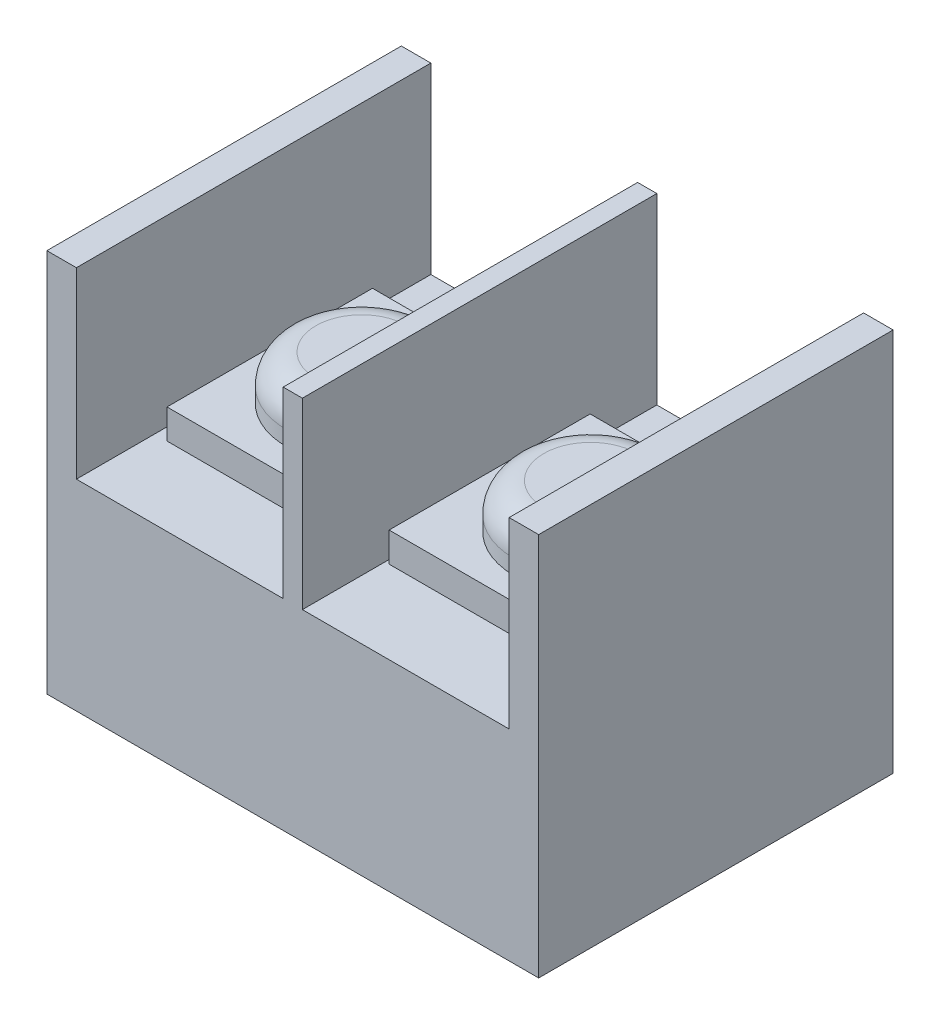
ISO-10303-21;
HEADER;
FILE_DESCRIPTION(('STEP AP214'),'2;1');
FILE_NAME('part.step','',(''),(''),'','','');
FILE_SCHEMA(('AUTOMOTIVE_DESIGN { 1 0 10303 214 1 1 1 1 }'));
ENDSEC;
DATA;
#1=APPLICATION_CONTEXT('core data for automotive mechanical design processes');
#2=APPLICATION_PROTOCOL_DEFINITION('international standard','automotive_design',2000,#1);
#3=PRODUCT_CONTEXT('',#1,'mechanical');
#4=PRODUCT('Part','Part','',(#3));
#5=PRODUCT_RELATED_PRODUCT_CATEGORY('part','',(#4));
#6=PRODUCT_DEFINITION_FORMATION('','',#4);
#7=PRODUCT_DEFINITION_CONTEXT('part definition',#1,'design');
#8=PRODUCT_DEFINITION('design','',#6,#7);
#9=PRODUCT_DEFINITION_SHAPE('','',#8);
#10=(LENGTH_UNIT() NAMED_UNIT(*) SI_UNIT(.MILLI.,.METRE.));
#11=(NAMED_UNIT(*) PLANE_ANGLE_UNIT() SI_UNIT($,.RADIAN.));
#12=(NAMED_UNIT(*) SI_UNIT($,.STERADIAN.) SOLID_ANGLE_UNIT());
#13=UNCERTAINTY_MEASURE_WITH_UNIT(LENGTH_MEASURE(1.E-05),#10,'distance_accuracy_value','');
#14=(GEOMETRIC_REPRESENTATION_CONTEXT(3) GLOBAL_UNCERTAINTY_ASSIGNED_CONTEXT((#13)) GLOBAL_UNIT_ASSIGNED_CONTEXT((#10,
#11,#12)) REPRESENTATION_CONTEXT('',''));
#15=CARTESIAN_POINT('',(0.,0.,0.));
#16=DIRECTION('',(0.,0.,1.));
#17=DIRECTION('',(1.,0.,0.));
#18=AXIS2_PLACEMENT_3D('',#15,#16,#17);
#19=CARTESIAN_POINT('',(-0.133958652373657,6.8,-7.62940275650842));
#20=DIRECTION('',(0.,-1.,0.));
#21=DIRECTION('',(1.,0.,0.));
#22=AXIS2_PLACEMENT_3D('',#19,#20,#21);
#23=PLANE('',#22);
#24=DIRECTION('',(0.,0.,1.));
#25=VECTOR('',#24,1.);
#26=CARTESIAN_POINT('',(-0.133958652373657,6.8,-7.62940275650842));
#27=LINE('',#26,#25);
#28=CARTESIAN_POINT('',(-0.133958652373657,6.8,-6.62940275650842));
#29=VERTEX_POINT('',#28);
#30=CARTESIAN_POINT('',(-0.133958652373657,6.8,5.37059724349158));
#31=VERTEX_POINT('',#30);
#32=EDGE_CURVE('E253',#29,#31,#27,.T.);
#33=ORIENTED_EDGE('',*,*,#32,.T.);
#34=DIRECTION('',(1.,0.,0.));
#35=VECTOR('',#34,1.);
#36=CARTESIAN_POINT('',(-0.133958652373657,6.8,5.37059724349158));
#37=LINE('',#36,#35);
#38=CARTESIAN_POINT('',(6.86604134762634,6.8,5.37059724349158));
#39=VERTEX_POINT('',#38);
#40=EDGE_CURVE('E248',#31,#39,#37,.T.);
#41=ORIENTED_EDGE('',*,*,#40,.T.);
#42=DIRECTION('',(0.,0.,1.));
#43=VECTOR('',#42,1.);
#44=CARTESIAN_POINT('',(6.86604134762634,6.8,-7.62940275650842));
#45=LINE('',#44,#43);
#46=CARTESIAN_POINT('',(6.86604134762634,6.8,-6.62940275650842));
#47=VERTEX_POINT('',#46);
#48=EDGE_CURVE('E236',#47,#39,#45,.T.);
#49=ORIENTED_EDGE('',*,*,#48,.F.);
#50=DIRECTION('',(1.,0.,0.));
#51=VECTOR('',#50,1.);
#52=CARTESIAN_POINT('',(-8.78395865237366,6.8,-6.62940275650842));
#53=LINE('',#52,#51);
#54=EDGE_CURVE('E311',#29,#47,#53,.T.);
#55=ORIENTED_EDGE('',*,*,#54,.F.);
#56=EDGE_LOOP('',(#33,#41,#49,#55));
#57=FACE_BOUND('',#56,.T.);
#58=DIRECTION('',(0.,0.,1.));
#59=VECTOR('',#58,1.);
#60=CARTESIAN_POINT('',(0.,6.8,-4.23776581016648));
#61=LINE('',#60,#59);
#62=CARTESIAN_POINT('',(0.,6.8,-4.23776581016648));
#63=VERTEX_POINT('',#62);
#64=CARTESIAN_POINT('',(0.,6.8,2.56891904105213));
#65=VERTEX_POINT('',#64);
#66=EDGE_CURVE('E192',#63,#65,#61,.T.);
#67=ORIENTED_EDGE('',*,*,#66,.F.);
#68=DIRECTION('',(-1.,0.,0.));
#69=VECTOR('',#68,1.);
#70=CARTESIAN_POINT('',(0.,6.8,-4.23776581016648));
#71=LINE('',#70,#69);
#72=CARTESIAN_POINT('',(6.60058497343841,6.8,-4.23776581016648));
#73=VERTEX_POINT('',#72);
#74=EDGE_CURVE('E189',#73,#63,#71,.T.);
#75=ORIENTED_EDGE('',*,*,#74,.F.);
#76=DIRECTION('',(0.,0.,-1.));
#77=VECTOR('',#76,1.);
#78=CARTESIAN_POINT('',(6.60058497343841,6.8,-4.23776581016648));
#79=LINE('',#78,#77);
#80=CARTESIAN_POINT('',(6.60058497343841,6.8,2.56891904105213));
#81=VERTEX_POINT('',#80);
#82=EDGE_CURVE('E55',#81,#73,#79,.T.);
#83=ORIENTED_EDGE('',*,*,#82,.F.);
#84=DIRECTION('',(1.,0.,0.));
#85=VECTOR('',#84,1.);
#86=CARTESIAN_POINT('',(0.,6.8,2.56891904105213));
#87=LINE('',#86,#85);
#88=EDGE_CURVE('E50',#65,#81,#87,.T.);
#89=ORIENTED_EDGE('',*,*,#88,.F.);
#90=EDGE_LOOP('',(#67,#75,#83,#89));
#91=FACE_BOUND('',#90,.T.);
#92=ADVANCED_FACE('F35',(#57,#91),#23,.F.);
#93=CARTESIAN_POINT('',(-7.78395865237366,6.8,-7.62940275650842));
#94=DIRECTION('',(0.,-1.,0.));
#95=DIRECTION('',(1.,0.,0.));
#96=AXIS2_PLACEMENT_3D('',#93,#94,#95);
#97=PLANE('',#96);
#98=DIRECTION('',(0.,0.,1.));
#99=VECTOR('',#98,1.);
#100=CARTESIAN_POINT('',(-7.78395865237366,6.8,-7.62940275650842));
#101=LINE('',#100,#99);
#102=CARTESIAN_POINT('',(-7.78395865237366,6.8,-6.62940275650842));
#103=VERTEX_POINT('',#102);
#104=CARTESIAN_POINT('',(-7.78395865237366,6.8,5.37059724349158));
#105=VERTEX_POINT('',#104);
#106=EDGE_CURVE('E241',#103,#105,#101,.T.);
#107=ORIENTED_EDGE('',*,*,#106,.T.);
#108=DIRECTION('',(1.,0.,0.));
#109=VECTOR('',#108,1.);
#110=CARTESIAN_POINT('',(-7.78395865237366,6.8,5.37059724349158));
#111=LINE('',#110,#109);
#112=CARTESIAN_POINT('',(-0.783958652373657,6.8,5.37059724349158));
#113=VERTEX_POINT('',#112);
#114=EDGE_CURVE('E235',#105,#113,#111,.T.);
#115=ORIENTED_EDGE('',*,*,#114,.T.);
#116=DIRECTION('',(0.,0.,1.));
#117=VECTOR('',#116,1.);
#118=CARTESIAN_POINT('',(-0.783958652373657,6.8,-7.62940275650842));
#119=LINE('',#118,#117);
#120=CARTESIAN_POINT('',(-0.783958652373657,6.8,-6.62940275650842));
#121=VERTEX_POINT('',#120);
#122=EDGE_CURVE('E242',#121,#113,#119,.T.);
#123=ORIENTED_EDGE('',*,*,#122,.F.);
#124=DIRECTION('',(1.,0.,0.));
#125=VECTOR('',#124,1.);
#126=CARTESIAN_POINT('',(-8.78395865237366,6.8,-6.62940275650842));
#127=LINE('',#126,#125);
#128=EDGE_CURVE('E314',#103,#121,#127,.T.);
#129=ORIENTED_EDGE('',*,*,#128,.F.);
#130=EDGE_LOOP('',(#107,#115,#123,#129));
#131=FACE_BOUND('',#130,.T.);
#132=DIRECTION('',(0.,0.,1.));
#133=VECTOR('',#132,1.);
#134=CARTESIAN_POINT('',(-7.36815381761664,6.8,-4.23776581016648));
#135=LINE('',#134,#133);
#136=CARTESIAN_POINT('',(-7.36815381761664,6.8,-4.23776581016648));
#137=VERTEX_POINT('',#136);
#138=CARTESIAN_POINT('',(-7.36815381761664,6.8,2.71926750162121));
#139=VERTEX_POINT('',#138);
#140=EDGE_CURVE('E193',#137,#139,#135,.T.);
#141=ORIENTED_EDGE('',*,*,#140,.F.);
#142=DIRECTION('',(-1.,0.,0.));
#143=VECTOR('',#142,1.);
#144=CARTESIAN_POINT('',(-7.36815381761664,6.8,-4.23776581016648));
#145=LINE('',#144,#143);
#146=CARTESIAN_POINT('',(-1.01251434810529,6.8,-4.23776581016648));
#147=VERTEX_POINT('',#146);
#148=EDGE_CURVE('E206',#147,#137,#145,.T.);
#149=ORIENTED_EDGE('',*,*,#148,.F.);
#150=DIRECTION('',(0.,0.,-1.));
#151=VECTOR('',#150,1.);
#152=CARTESIAN_POINT('',(-1.01251434810529,6.8,-4.23776581016648));
#153=LINE('',#152,#151);
#154=CARTESIAN_POINT('',(-1.01251434810529,6.8,2.71926750162121));
#155=VERTEX_POINT('',#154);
#156=EDGE_CURVE('E215',#155,#147,#153,.T.);
#157=ORIENTED_EDGE('',*,*,#156,.F.);
#158=DIRECTION('',(1.,0.,0.));
#159=VECTOR('',#158,1.);
#160=CARTESIAN_POINT('',(-7.36815381761664,6.8,2.71926750162121));
#161=LINE('',#160,#159);
#162=EDGE_CURVE('E196',#139,#155,#161,.T.);
#163=ORIENTED_EDGE('',*,*,#162,.F.);
#164=EDGE_LOOP('',(#141,#149,#157,#163));
#165=FACE_BOUND('',#164,.T.);
#166=ADVANCED_FACE('F339',(#131,#165),#97,.F.);
#167=CARTESIAN_POINT('',(0.,13.,0.));
#168=DIRECTION('',(0.,1.,0.));
#169=DIRECTION('',(0.,0.,1.));
#170=AXIS2_PLACEMENT_3D('',#167,#168,#169);
#171=PLANE('',#170);
#172=DIRECTION('',(0.,0.,1.));
#173=VECTOR('',#172,1.);
#174=CARTESIAN_POINT('',(-7.78395865237366,13.,0.));
#175=LINE('',#174,#173);
#176=CARTESIAN_POINT('',(-7.78395865237366,13.,-6.62940275650842));
#177=VERTEX_POINT('',#176);
#178=CARTESIAN_POINT('',(-7.78395865237366,13.,5.37059724349158));
#179=VERTEX_POINT('',#178);
#180=EDGE_CURVE('E309',#177,#179,#175,.T.);
#181=ORIENTED_EDGE('',*,*,#180,.F.);
#182=DIRECTION('',(-1.,0.,0.));
#183=VECTOR('',#182,1.);
#184=CARTESIAN_POINT('',(-8.78395865237366,13.,-6.62940275650842));
#185=LINE('',#184,#183);
#186=CARTESIAN_POINT('',(-8.78395865237366,13.,-6.62940275650842));
#187=VERTEX_POINT('',#186);
#188=EDGE_CURVE('E279',#177,#187,#185,.T.);
#189=ORIENTED_EDGE('',*,*,#188,.T.);
#190=DIRECTION('',(0.,0.,1.));
#191=VECTOR('',#190,1.);
#192=CARTESIAN_POINT('',(-8.78395865237366,13.,-6.62940275650842));
#193=LINE('',#192,#191);
#194=CARTESIAN_POINT('',(-8.78395865237366,13.,5.37059724349158));
#195=VERTEX_POINT('',#194);
#196=EDGE_CURVE('E268',#187,#195,#193,.T.);
#197=ORIENTED_EDGE('',*,*,#196,.T.);
#198=DIRECTION('',(1.,0.,0.));
#199=VECTOR('',#198,1.);
#200=CARTESIAN_POINT('',(-8.78395865237366,13.,5.37059724349158));
#201=LINE('',#200,#199);
#202=EDGE_CURVE('E273',#195,#179,#201,.T.);
#203=ORIENTED_EDGE('',*,*,#202,.T.);
#204=EDGE_LOOP('',(#181,#189,#197,#203));
#205=FACE_BOUND('',#204,.T.);
#206=ADVANCED_FACE('F345',(#205),#171,.T.);
#207=DIRECTION('',(0.,0.,-1.));
#208=VECTOR('',#207,1.);
#209=CARTESIAN_POINT('',(-0.783958652373658,13.,0.));
#210=LINE('',#209,#208);
#211=CARTESIAN_POINT('',(-0.783958652373656,13.,5.37059724349158));
#212=VERTEX_POINT('',#211);
#213=CARTESIAN_POINT('',(-0.783958652373658,13.,-6.62940275650842));
#214=VERTEX_POINT('',#213);
#215=EDGE_CURVE('E307',#212,#214,#210,.T.);
#216=ORIENTED_EDGE('',*,*,#215,.F.);
#217=CARTESIAN_POINT('',(-0.133958652373658,13.,5.37059724349158));
#218=VERTEX_POINT('',#217);
#219=EDGE_CURVE('E277',#212,#218,#201,.T.);
#220=ORIENTED_EDGE('',*,*,#219,.T.);
#221=DIRECTION('',(0.,0.,1.));
#222=VECTOR('',#221,1.);
#223=CARTESIAN_POINT('',(-0.133958652373658,13.,0.));
#224=LINE('',#223,#222);
#225=CARTESIAN_POINT('',(-0.133958652373658,13.,-6.62940275650842));
#226=VERTEX_POINT('',#225);
#227=EDGE_CURVE('E305',#226,#218,#224,.T.);
#228=ORIENTED_EDGE('',*,*,#227,.F.);
#229=EDGE_CURVE('E284',#226,#214,#185,.T.);
#230=ORIENTED_EDGE('',*,*,#229,.T.);
#231=EDGE_LOOP('',(#216,#220,#228,#230));
#232=FACE_BOUND('',#231,.T.);
#233=ADVANCED_FACE('F362',(#232),#171,.T.);
#234=CARTESIAN_POINT('',(-8.78395865237366,13.,-6.62940275650842));
#235=DIRECTION('',(1.,0.,0.));
#236=DIRECTION('',(0.,0.,-1.));
#237=AXIS2_PLACEMENT_3D('',#234,#235,#236);
#238=PLANE('',#237);
#239=DIRECTION('',(0.,0.,1.));
#240=VECTOR('',#239,1.);
#241=CARTESIAN_POINT('',(-8.78395865237366,0.,-6.62940275650842));
#242=LINE('',#241,#240);
#243=CARTESIAN_POINT('',(-8.78395865237366,0.,-6.62940275650842));
#244=VERTEX_POINT('',#243);
#245=CARTESIAN_POINT('',(-8.78395865237366,0.,5.37059724349158));
#246=VERTEX_POINT('',#245);
#247=EDGE_CURVE('E267',#244,#246,#242,.T.);
#248=ORIENTED_EDGE('',*,*,#247,.T.);
#249=DIRECTION('',(0.,-1.,0.));
#250=VECTOR('',#249,1.);
#251=CARTESIAN_POINT('',(-8.78395865237366,13.,5.37059724349158));
#252=LINE('',#251,#250);
#253=EDGE_CURVE('E300',#195,#246,#252,.T.);
#254=ORIENTED_EDGE('',*,*,#253,.F.);
#255=ORIENTED_EDGE('',*,*,#196,.F.);
#256=DIRECTION('',(0.,-1.,0.));
#257=VECTOR('',#256,1.);
#258=CARTESIAN_POINT('',(-8.78395865237366,13.,-6.62940275650842));
#259=LINE('',#258,#257);
#260=EDGE_CURVE('E283',#187,#244,#259,.T.);
#261=ORIENTED_EDGE('',*,*,#260,.T.);
#262=EDGE_LOOP('',(#248,#254,#255,#261));
#263=FACE_BOUND('',#262,.T.);
#264=ADVANCED_FACE('F376',(#263),#238,.F.);
#265=CARTESIAN_POINT('',(-8.78395865237366,13.,5.37059724349158));
#266=DIRECTION('',(0.,0.,-1.));
#267=DIRECTION('',(-1.,0.,0.));
#268=AXIS2_PLACEMENT_3D('',#265,#266,#267);
#269=PLANE('',#268);
#270=ORIENTED_EDGE('',*,*,#114,.F.);
#271=DIRECTION('',(0.,-1.,0.));
#272=VECTOR('',#271,1.);
#273=CARTESIAN_POINT('',(-7.78395865237366,17.3249514809849,5.37059724349158));
#274=LINE('',#273,#272);
#275=EDGE_CURVE('E232',#179,#105,#274,.T.);
#276=ORIENTED_EDGE('',*,*,#275,.F.);
#277=ORIENTED_EDGE('',*,*,#202,.F.);
#278=ORIENTED_EDGE('',*,*,#253,.T.);
#279=DIRECTION('',(1.,0.,0.));
#280=VECTOR('',#279,1.);
#281=CARTESIAN_POINT('',(-8.78395865237366,0.,5.37059724349158));
#282=LINE('',#281,#280);
#283=CARTESIAN_POINT('',(7.86604134762634,0.,5.37059724349158));
#284=VERTEX_POINT('',#283);
#285=EDGE_CURVE('E287',#246,#284,#282,.T.);
#286=ORIENTED_EDGE('',*,*,#285,.T.);
#287=DIRECTION('',(0.,-1.,0.));
#288=VECTOR('',#287,1.);
#289=CARTESIAN_POINT('',(7.86604134762634,13.,5.37059724349158));
#290=LINE('',#289,#288);
#291=CARTESIAN_POINT('',(7.86604134762634,13.,5.37059724349158));
#292=VERTEX_POINT('',#291);
#293=EDGE_CURVE('E297',#292,#284,#290,.T.);
#294=ORIENTED_EDGE('',*,*,#293,.F.);
#295=CARTESIAN_POINT('',(6.86604134762634,13.,5.37059724349158));
#296=VERTEX_POINT('',#295);
#297=EDGE_CURVE('E271',#296,#292,#201,.T.);
#298=ORIENTED_EDGE('',*,*,#297,.F.);
#299=DIRECTION('',(0.,1.,0.));
#300=VECTOR('',#299,1.);
#301=CARTESIAN_POINT('',(6.86604134762634,17.3249514809849,5.37059724349158));
#302=LINE('',#301,#300);
#303=EDGE_CURVE('E251',#39,#296,#302,.T.);
#304=ORIENTED_EDGE('',*,*,#303,.F.);
#305=ORIENTED_EDGE('',*,*,#40,.F.);
#306=DIRECTION('',(0.,-1.,0.));
#307=VECTOR('',#306,1.);
#308=CARTESIAN_POINT('',(-0.133958652373659,17.3249514809849,5.37059724349158));
#309=LINE('',#308,#307);
#310=EDGE_CURVE('E231',#218,#31,#309,.T.);
#311=ORIENTED_EDGE('',*,*,#310,.F.);
#312=ORIENTED_EDGE('',*,*,#219,.F.);
#313=DIRECTION('',(0.,1.,0.));
#314=VECTOR('',#313,1.);
#315=CARTESIAN_POINT('',(-0.783958652373658,17.3249514809849,5.37059724349158));
#316=LINE('',#315,#314);
#317=EDGE_CURVE('E239',#113,#212,#316,.T.);
#318=ORIENTED_EDGE('',*,*,#317,.F.);
#319=EDGE_LOOP('',(#270,#276,#277,#278,#286,#294,#298,#304,#305,#311,#312,#318));
#320=FACE_BOUND('',#319,.T.);
#321=ADVANCED_FACE('F372',(#320),#269,.F.);
#322=CARTESIAN_POINT('',(7.86604134762634,13.,-6.62940275650842));
#323=DIRECTION('',(-1.,0.,0.));
#324=DIRECTION('',(0.,0.,1.));
#325=AXIS2_PLACEMENT_3D('',#322,#323,#324);
#326=PLANE('',#325);
#327=DIRECTION('',(0.,0.,-1.));
#328=VECTOR('',#327,1.);
#329=CARTESIAN_POINT('',(7.86604134762634,0.,-6.62940275650842));
#330=LINE('',#329,#328);
#331=CARTESIAN_POINT('',(7.86604134762634,0.,-6.62940275650842));
#332=VERTEX_POINT('',#331);
#333=EDGE_CURVE('E289',#284,#332,#330,.T.);
#334=ORIENTED_EDGE('',*,*,#333,.T.);
#335=DIRECTION('',(0.,-1.,0.));
#336=VECTOR('',#335,1.);
#337=CARTESIAN_POINT('',(7.86604134762634,13.,-6.62940275650842));
#338=LINE('',#337,#336);
#339=CARTESIAN_POINT('',(7.86604134762634,13.,-6.62940275650842));
#340=VERTEX_POINT('',#339);
#341=EDGE_CURVE('E294',#340,#332,#338,.T.);
#342=ORIENTED_EDGE('',*,*,#341,.F.);
#343=DIRECTION('',(0.,0.,-1.));
#344=VECTOR('',#343,1.);
#345=CARTESIAN_POINT('',(7.86604134762634,13.,-6.62940275650842));
#346=LINE('',#345,#344);
#347=EDGE_CURVE('E276',#292,#340,#346,.T.);
#348=ORIENTED_EDGE('',*,*,#347,.F.);
#349=ORIENTED_EDGE('',*,*,#293,.T.);
#350=EDGE_LOOP('',(#334,#342,#348,#349));
#351=FACE_BOUND('',#350,.T.);
#352=ADVANCED_FACE('F368',(#351),#326,.F.);
#353=CARTESIAN_POINT('',(-8.78395865237366,13.,-6.62940275650842));
#354=DIRECTION('',(0.,0.,1.));
#355=DIRECTION('',(1.,0.,0.));
#356=AXIS2_PLACEMENT_3D('',#353,#354,#355);
#357=PLANE('',#356);
#358=ORIENTED_EDGE('',*,*,#188,.F.);
#359=DIRECTION('',(0.,-1.,0.));
#360=VECTOR('',#359,1.);
#361=CARTESIAN_POINT('',(-7.78395865237366,13.,-6.62940275650842));
#362=LINE('',#361,#360);
#363=EDGE_CURVE('E264',#177,#103,#362,.T.);
#364=ORIENTED_EDGE('',*,*,#363,.T.);
#365=ORIENTED_EDGE('',*,*,#128,.T.);
#366=DIRECTION('',(0.,1.,0.));
#367=VECTOR('',#366,1.);
#368=CARTESIAN_POINT('',(-0.78395865237366,13.,-6.62940275650842));
#369=LINE('',#368,#367);
#370=EDGE_CURVE('E261',#121,#214,#369,.T.);
#371=ORIENTED_EDGE('',*,*,#370,.T.);
#372=ORIENTED_EDGE('',*,*,#229,.F.);
#373=DIRECTION('',(0.,-1.,0.));
#374=VECTOR('',#373,1.);
#375=CARTESIAN_POINT('',(-0.13395865237366,13.,-6.62940275650842));
#376=LINE('',#375,#374);
#377=EDGE_CURVE('E258',#226,#29,#376,.T.);
#378=ORIENTED_EDGE('',*,*,#377,.T.);
#379=ORIENTED_EDGE('',*,*,#54,.T.);
#380=DIRECTION('',(0.,1.,0.));
#381=VECTOR('',#380,1.);
#382=CARTESIAN_POINT('',(6.86604134762634,13.,-6.62940275650842));
#383=LINE('',#382,#381);
#384=CARTESIAN_POINT('',(6.86604134762634,13.,-6.62940275650842));
#385=VERTEX_POINT('',#384);
#386=EDGE_CURVE('E244',#47,#385,#383,.T.);
#387=ORIENTED_EDGE('',*,*,#386,.T.);
#388=EDGE_CURVE('E280',#340,#385,#185,.T.);
#389=ORIENTED_EDGE('',*,*,#388,.F.);
#390=ORIENTED_EDGE('',*,*,#341,.T.);
#391=DIRECTION('',(-1.,0.,0.));
#392=VECTOR('',#391,1.);
#393=CARTESIAN_POINT('',(-8.78395865237366,0.,-6.62940275650842));
#394=LINE('',#393,#392);
#395=EDGE_CURVE('E272',#332,#244,#394,.T.);
#396=ORIENTED_EDGE('',*,*,#395,.T.);
#397=ORIENTED_EDGE('',*,*,#260,.F.);
#398=EDGE_LOOP('',(#358,#364,#365,#371,#372,#378,#379,#387,#389,#390,#396,#397));
#399=FACE_BOUND('',#398,.T.);
#400=ADVANCED_FACE('F360',(#399),#357,.F.);
#401=DIRECTION('',(0.,0.,-1.));
#402=VECTOR('',#401,1.);
#403=CARTESIAN_POINT('',(6.86604134762634,13.,0.));
#404=LINE('',#403,#402);
#405=EDGE_CURVE('E303',#296,#385,#404,.T.);
#406=ORIENTED_EDGE('',*,*,#405,.F.);
#407=ORIENTED_EDGE('',*,*,#297,.T.);
#408=ORIENTED_EDGE('',*,*,#347,.T.);
#409=ORIENTED_EDGE('',*,*,#388,.T.);
#410=EDGE_LOOP('',(#406,#407,#408,#409));
#411=FACE_BOUND('',#410,.T.);
#412=ADVANCED_FACE('F357',(#411),#171,.T.);
#413=CARTESIAN_POINT('',(0.,0.,0.));
#414=DIRECTION('',(0.,1.,0.));
#415=DIRECTION('',(0.,0.,1.));
#416=AXIS2_PLACEMENT_3D('',#413,#414,#415);
#417=PLANE('',#416);
#418=ORIENTED_EDGE('',*,*,#247,.F.);
#419=ORIENTED_EDGE('',*,*,#395,.F.);
#420=ORIENTED_EDGE('',*,*,#333,.F.);
#421=ORIENTED_EDGE('',*,*,#285,.F.);
#422=EDGE_LOOP('',(#418,#419,#420,#421));
#423=FACE_BOUND('',#422,.T.);
#424=ADVANCED_FACE('F355',(#423),#417,.F.);
#425=CARTESIAN_POINT('',(-0.133958652373659,17.3249514809849,-7.62940275650842));
#426=DIRECTION('',(-1.,0.,0.));
#427=DIRECTION('',(0.,-1.,0.));
#428=AXIS2_PLACEMENT_3D('',#425,#426,#427);
#429=PLANE('',#428);
#430=ORIENTED_EDGE('',*,*,#227,.T.);
#431=ORIENTED_EDGE('',*,*,#310,.T.);
#432=ORIENTED_EDGE('',*,*,#32,.F.);
#433=ORIENTED_EDGE('',*,*,#377,.F.);
#434=EDGE_LOOP('',(#430,#431,#432,#433));
#435=FACE_BOUND('',#434,.T.);
#436=ADVANCED_FACE('F352',(#435),#429,.F.);
#437=CARTESIAN_POINT('',(6.86604134762634,17.3249514809849,-7.62940275650842));
#438=DIRECTION('',(1.,0.,0.));
#439=DIRECTION('',(0.,0.,-1.));
#440=AXIS2_PLACEMENT_3D('',#437,#438,#439);
#441=PLANE('',#440);
#442=ORIENTED_EDGE('',*,*,#48,.T.);
#443=ORIENTED_EDGE('',*,*,#303,.T.);
#444=ORIENTED_EDGE('',*,*,#405,.T.);
#445=ORIENTED_EDGE('',*,*,#386,.F.);
#446=EDGE_LOOP('',(#442,#443,#444,#445));
#447=FACE_BOUND('',#446,.T.);
#448=ADVANCED_FACE('F350',(#447),#441,.F.);
#449=CARTESIAN_POINT('',(-7.78395865237366,17.3249514809849,-7.62940275650842));
#450=DIRECTION('',(-1.,0.,0.));
#451=DIRECTION('',(0.,0.,1.));
#452=AXIS2_PLACEMENT_3D('',#449,#450,#451);
#453=PLANE('',#452);
#454=ORIENTED_EDGE('',*,*,#180,.T.);
#455=ORIENTED_EDGE('',*,*,#275,.T.);
#456=ORIENTED_EDGE('',*,*,#106,.F.);
#457=ORIENTED_EDGE('',*,*,#363,.F.);
#458=EDGE_LOOP('',(#454,#455,#456,#457));
#459=FACE_BOUND('',#458,.T.);
#460=ADVANCED_FACE('F418',(#459),#453,.F.);
#461=CARTESIAN_POINT('',(-0.783958652373658,17.3249514809849,-7.62940275650842));
#462=DIRECTION('',(1.,0.,0.));
#463=DIRECTION('',(0.,1.,0.));
#464=AXIS2_PLACEMENT_3D('',#461,#462,#463);
#465=PLANE('',#464);
#466=ORIENTED_EDGE('',*,*,#122,.T.);
#467=ORIENTED_EDGE('',*,*,#317,.T.);
#468=ORIENTED_EDGE('',*,*,#215,.T.);
#469=ORIENTED_EDGE('',*,*,#370,.F.);
#470=EDGE_LOOP('',(#466,#467,#468,#469));
#471=FACE_BOUND('',#470,.T.);
#472=ADVANCED_FACE('F414',(#471),#465,.F.);
#473=CARTESIAN_POINT('',(-7.36815381761664,7.8,-4.23776581016648));
#474=DIRECTION('',(1.,0.,0.));
#475=DIRECTION('',(0.,1.,0.));
#476=AXIS2_PLACEMENT_3D('',#473,#474,#475);
#477=PLANE('',#476);
#478=ORIENTED_EDGE('',*,*,#140,.T.);
#479=DIRECTION('',(0.,-1.,0.));
#480=VECTOR('',#479,1.);
#481=CARTESIAN_POINT('',(-7.36815381761664,7.8,2.71926750162121));
#482=LINE('',#481,#480);
#483=CARTESIAN_POINT('',(-7.36815381761664,7.8,2.71926750162121));
#484=VERTEX_POINT('',#483);
#485=EDGE_CURVE('E228',#484,#139,#482,.T.);
#486=ORIENTED_EDGE('',*,*,#485,.F.);
#487=DIRECTION('',(0.,0.,1.));
#488=VECTOR('',#487,1.);
#489=CARTESIAN_POINT('',(-7.36815381761664,7.8,-4.23776581016648));
#490=LINE('',#489,#488);
#491=CARTESIAN_POINT('',(-7.36815381761664,7.8,-4.23776581016648));
#492=VERTEX_POINT('',#491);
#493=EDGE_CURVE('E202',#492,#484,#490,.T.);
#494=ORIENTED_EDGE('',*,*,#493,.F.);
#495=DIRECTION('',(0.,-1.,0.));
#496=VECTOR('',#495,1.);
#497=CARTESIAN_POINT('',(-7.36815381761664,7.8,-4.23776581016648));
#498=LINE('',#497,#496);
#499=EDGE_CURVE('E211',#492,#137,#498,.T.);
#500=ORIENTED_EDGE('',*,*,#499,.T.);
#501=EDGE_LOOP('',(#478,#486,#494,#500));
#502=FACE_BOUND('',#501,.T.);
#503=ADVANCED_FACE('F424',(#502),#477,.F.);
#504=CARTESIAN_POINT('',(-7.36815381761664,7.8,2.71926750162121));
#505=DIRECTION('',(0.,0.,-1.));
#506=DIRECTION('',(-1.,0.,0.));
#507=AXIS2_PLACEMENT_3D('',#504,#505,#506);
#508=PLANE('',#507);
#509=ORIENTED_EDGE('',*,*,#162,.T.);
#510=DIRECTION('',(0.,-1.,0.));
#511=VECTOR('',#510,1.);
#512=CARTESIAN_POINT('',(-1.01251434810529,7.8,2.71926750162121));
#513=LINE('',#512,#511);
#514=CARTESIAN_POINT('',(-1.01251434810529,7.8,2.71926750162121));
#515=VERTEX_POINT('',#514);
#516=EDGE_CURVE('E225',#515,#155,#513,.T.);
#517=ORIENTED_EDGE('',*,*,#516,.F.);
#518=DIRECTION('',(1.,0.,0.));
#519=VECTOR('',#518,1.);
#520=CARTESIAN_POINT('',(-7.36815381761664,7.8,2.71926750162121));
#521=LINE('',#520,#519);
#522=EDGE_CURVE('E205',#484,#515,#521,.T.);
#523=ORIENTED_EDGE('',*,*,#522,.F.);
#524=ORIENTED_EDGE('',*,*,#485,.T.);
#525=EDGE_LOOP('',(#509,#517,#523,#524));
#526=FACE_BOUND('',#525,.T.);
#527=ADVANCED_FACE('F430',(#526),#508,.F.);
#528=CARTESIAN_POINT('',(-1.01251434810529,7.8,-4.23776581016648));
#529=DIRECTION('',(-1.,0.,0.));
#530=DIRECTION('',(0.,-1.,0.));
#531=AXIS2_PLACEMENT_3D('',#528,#529,#530);
#532=PLANE('',#531);
#533=ORIENTED_EDGE('',*,*,#156,.T.);
#534=DIRECTION('',(0.,-1.,0.));
#535=VECTOR('',#534,1.);
#536=CARTESIAN_POINT('',(-1.01251434810529,7.8,-4.23776581016648));
#537=LINE('',#536,#535);
#538=CARTESIAN_POINT('',(-1.01251434810529,7.8,-4.23776581016648));
#539=VERTEX_POINT('',#538);
#540=EDGE_CURVE('E222',#539,#147,#537,.T.);
#541=ORIENTED_EDGE('',*,*,#540,.F.);
#542=DIRECTION('',(0.,0.,-1.));
#543=VECTOR('',#542,1.);
#544=CARTESIAN_POINT('',(-1.01251434810529,7.8,-4.23776581016648));
#545=LINE('',#544,#543);
#546=EDGE_CURVE('E208',#515,#539,#545,.T.);
#547=ORIENTED_EDGE('',*,*,#546,.F.);
#548=ORIENTED_EDGE('',*,*,#516,.T.);
#549=EDGE_LOOP('',(#533,#541,#547,#548));
#550=FACE_BOUND('',#549,.T.);
#551=ADVANCED_FACE('F434',(#550),#532,.F.);
#552=CARTESIAN_POINT('',(-7.36815381761664,7.8,-4.23776581016648));
#553=DIRECTION('',(0.,0.,1.));
#554=DIRECTION('',(1.,0.,0.));
#555=AXIS2_PLACEMENT_3D('',#552,#553,#554);
#556=PLANE('',#555);
#557=ORIENTED_EDGE('',*,*,#148,.T.);
#558=ORIENTED_EDGE('',*,*,#499,.F.);
#559=DIRECTION('',(-1.,0.,0.));
#560=VECTOR('',#559,1.);
#561=CARTESIAN_POINT('',(-7.36815381761664,7.8,-4.23776581016648));
#562=LINE('',#561,#560);
#563=EDGE_CURVE('E210',#539,#492,#562,.T.);
#564=ORIENTED_EDGE('',*,*,#563,.F.);
#565=ORIENTED_EDGE('',*,*,#540,.T.);
#566=EDGE_LOOP('',(#557,#558,#564,#565));
#567=FACE_BOUND('',#566,.T.);
#568=ADVANCED_FACE('F438',(#567),#556,.F.);
#569=CARTESIAN_POINT('',(0.,7.8,0.));
#570=DIRECTION('',(0.,1.,0.));
#571=DIRECTION('',(-1.,0.,0.));
#572=AXIS2_PLACEMENT_3D('',#569,#570,#571);
#573=PLANE('',#572);
#574=CARTESIAN_POINT('',(-4.18350006192601,7.8,-0.684074923988099));
#575=DIRECTION('',(0.,1.,0.));
#576=DIRECTION('',(-1.,0.,0.));
#577=AXIS2_PLACEMENT_3D('',#574,#575,#576);
#578=CIRCLE('',#577,2.54636757203357);
#579=CARTESIAN_POINT('',(-6.72986763395958,7.8,-0.684074923988099));
#580=VERTEX_POINT('',#579);
#581=EDGE_CURVE('E317',#580,#580,#578,.T.);
#582=ORIENTED_EDGE('',*,*,#581,.F.);
#583=EDGE_LOOP('',(#582));
#584=FACE_BOUND('',#583,.T.);
#585=ORIENTED_EDGE('',*,*,#493,.T.);
#586=ORIENTED_EDGE('',*,*,#522,.T.);
#587=ORIENTED_EDGE('',*,*,#546,.T.);
#588=ORIENTED_EDGE('',*,*,#563,.T.);
#589=EDGE_LOOP('',(#585,#586,#587,#588));
#590=FACE_BOUND('',#589,.T.);
#591=ADVANCED_FACE('F442',(#584,#590),#573,.T.);
#592=CARTESIAN_POINT('',(0.,7.8,-4.23776581016648));
#593=DIRECTION('',(1.,0.,0.));
#594=DIRECTION('',(0.,1.,0.));
#595=AXIS2_PLACEMENT_3D('',#592,#593,#594);
#596=PLANE('',#595);
#597=ORIENTED_EDGE('',*,*,#66,.T.);
#598=DIRECTION('',(0.,-1.,0.));
#599=VECTOR('',#598,1.);
#600=CARTESIAN_POINT('',(0.,7.8,2.56891904105213));
#601=LINE('',#600,#599);
#602=CARTESIAN_POINT('',(0.,7.8,2.56891904105213));
#603=VERTEX_POINT('',#602);
#604=EDGE_CURVE('E173',#603,#65,#601,.T.);
#605=ORIENTED_EDGE('',*,*,#604,.F.);
#606=DIRECTION('',(0.,0.,1.));
#607=VECTOR('',#606,1.);
#608=CARTESIAN_POINT('',(0.,7.8,-4.23776581016648));
#609=LINE('',#608,#607);
#610=CARTESIAN_POINT('',(0.,7.8,-4.23776581016648));
#611=VERTEX_POINT('',#610);
#612=EDGE_CURVE('E180',#611,#603,#609,.T.);
#613=ORIENTED_EDGE('',*,*,#612,.F.);
#614=DIRECTION('',(0.,-1.,0.));
#615=VECTOR('',#614,1.);
#616=CARTESIAN_POINT('',(0.,7.8,-4.23776581016648));
#617=LINE('',#616,#615);
#618=EDGE_CURVE('E681',#611,#63,#617,.T.);
#619=ORIENTED_EDGE('',*,*,#618,.T.);
#620=EDGE_LOOP('',(#597,#605,#613,#619));
#621=FACE_BOUND('',#620,.T.);
#622=ADVANCED_FACE('F191',(#621),#596,.F.);
#623=CARTESIAN_POINT('',(0.,7.8,2.56891904105213));
#624=DIRECTION('',(0.,0.,-1.));
#625=DIRECTION('',(-1.,0.,0.));
#626=AXIS2_PLACEMENT_3D('',#623,#624,#625);
#627=PLANE('',#626);
#628=ORIENTED_EDGE('',*,*,#88,.T.);
#629=DIRECTION('',(0.,-1.,0.));
#630=VECTOR('',#629,1.);
#631=CARTESIAN_POINT('',(6.60058497343841,7.8,2.56891904105213));
#632=LINE('',#631,#630);
#633=CARTESIAN_POINT('',(6.60058497343841,7.8,2.56891904105213));
#634=VERTEX_POINT('',#633);
#635=EDGE_CURVE('E176',#634,#81,#632,.T.);
#636=ORIENTED_EDGE('',*,*,#635,.F.);
#637=DIRECTION('',(1.,0.,0.));
#638=VECTOR('',#637,1.);
#639=CARTESIAN_POINT('',(0.,7.8,2.56891904105213));
#640=LINE('',#639,#638);
#641=EDGE_CURVE('E169',#603,#634,#640,.T.);
#642=ORIENTED_EDGE('',*,*,#641,.F.);
#643=ORIENTED_EDGE('',*,*,#604,.T.);
#644=EDGE_LOOP('',(#628,#636,#642,#643));
#645=FACE_BOUND('',#644,.T.);
#646=ADVANCED_FACE('F171',(#645),#627,.F.);
#647=CARTESIAN_POINT('',(6.60058497343841,7.8,-4.23776581016648));
#648=DIRECTION('',(-1.,0.,0.));
#649=DIRECTION('',(0.,-1.,0.));
#650=AXIS2_PLACEMENT_3D('',#647,#648,#649);
#651=PLANE('',#650);
#652=ORIENTED_EDGE('',*,*,#82,.T.);
#653=DIRECTION('',(0.,-1.,0.));
#654=VECTOR('',#653,1.);
#655=CARTESIAN_POINT('',(6.60058497343841,7.8,-4.23776581016648));
#656=LINE('',#655,#654);
#657=CARTESIAN_POINT('',(6.60058497343841,7.8,-4.23776581016648));
#658=VERTEX_POINT('',#657);
#659=EDGE_CURVE('E198',#658,#73,#656,.T.);
#660=ORIENTED_EDGE('',*,*,#659,.F.);
#661=DIRECTION('',(0.,0.,-1.));
#662=VECTOR('',#661,1.);
#663=CARTESIAN_POINT('',(6.60058497343841,7.8,-4.23776581016648));
#664=LINE('',#663,#662);
#665=EDGE_CURVE('E179',#634,#658,#664,.T.);
#666=ORIENTED_EDGE('',*,*,#665,.F.);
#667=ORIENTED_EDGE('',*,*,#635,.T.);
#668=EDGE_LOOP('',(#652,#660,#666,#667));
#669=FACE_BOUND('',#668,.T.);
#670=ADVANCED_FACE('F451',(#669),#651,.F.);
#671=CARTESIAN_POINT('',(0.,7.8,-4.23776581016648));
#672=DIRECTION('',(0.,0.,1.));
#673=DIRECTION('',(1.,0.,0.));
#674=AXIS2_PLACEMENT_3D('',#671,#672,#673);
#675=PLANE('',#674);
#676=ORIENTED_EDGE('',*,*,#74,.T.);
#677=ORIENTED_EDGE('',*,*,#618,.F.);
#678=DIRECTION('',(-1.,0.,0.));
#679=VECTOR('',#678,1.);
#680=CARTESIAN_POINT('',(0.,7.8,-4.23776581016648));
#681=LINE('',#680,#679);
#682=EDGE_CURVE('E185',#658,#611,#681,.T.);
#683=ORIENTED_EDGE('',*,*,#682,.F.);
#684=ORIENTED_EDGE('',*,*,#659,.T.);
#685=EDGE_LOOP('',(#676,#677,#683,#684));
#686=FACE_BOUND('',#685,.T.);
#687=ADVANCED_FACE('F454',(#686),#675,.F.);
#688=CARTESIAN_POINT('',(0.,7.8,0.));
#689=DIRECTION('',(0.,1.,0.));
#690=DIRECTION('',(-1.,0.,0.));
#691=AXIS2_PLACEMENT_3D('',#688,#689,#690);
#692=PLANE('',#691);
#693=CARTESIAN_POINT('',(3.45693534335753,7.8,-0.793419258947434));
#694=DIRECTION('',(0.,1.,0.));
#695=DIRECTION('',(-1.,0.,0.));
#696=AXIS2_PLACEMENT_3D('',#693,#694,#695);
#697=CIRCLE('',#696,2.58210257125068);
#698=CARTESIAN_POINT('',(0.874832772106852,7.8,-0.793419258947434));
#699=VERTEX_POINT('',#698);
#700=EDGE_CURVE('E322',#699,#699,#697,.T.);
#701=ORIENTED_EDGE('',*,*,#700,.F.);
#702=EDGE_LOOP('',(#701));
#703=FACE_BOUND('',#702,.T.);
#704=ORIENTED_EDGE('',*,*,#612,.T.);
#705=ORIENTED_EDGE('',*,*,#641,.T.);
#706=ORIENTED_EDGE('',*,*,#665,.T.);
#707=ORIENTED_EDGE('',*,*,#682,.T.);
#708=EDGE_LOOP('',(#704,#705,#706,#707));
#709=FACE_BOUND('',#708,.T.);
#710=ADVANCED_FACE('F183',(#703,#709),#692,.T.);
#711=CARTESIAN_POINT('',(-4.18350006192601,9.3,-0.684074923988099));
#712=DIRECTION('',(0.,-1.,0.));
#713=DIRECTION('',(1.,0.,0.));
#714=AXIS2_PLACEMENT_3D('',#711,#712,#713);
#715=CYLINDRICAL_SURFACE('',#714,2.54636757203357);
#716=CARTESIAN_POINT('',(-4.18350006192601,8.3,-0.684074923988099));
#717=DIRECTION('',(0.,1.,0.));
#718=DIRECTION('',(-1.,0.,0.));
#719=AXIS2_PLACEMENT_3D('',#716,#717,#718);
#720=CIRCLE('',#719,2.54636757203357);
#721=CARTESIAN_POINT('',(-6.72986763395958,8.3,-0.684074923988099));
#722=VERTEX_POINT('',#721);
#723=EDGE_CURVE('E11',#722,#722,#720,.F.);
#724=ORIENTED_EDGE('',*,*,#723,.T.);
#725=EDGE_LOOP('',(#724));
#726=FACE_BOUND('',#725,.T.);
#727=ORIENTED_EDGE('',*,*,#581,.T.);
#728=EDGE_LOOP('',(#727));
#729=FACE_BOUND('',#728,.T.);
#730=ADVANCED_FACE('F461',(#726,#729),#715,.T.);
#731=CARTESIAN_POINT('',(-4.18350006192601,9.3,-0.684074923988099));
#732=DIRECTION('',(0.,1.,0.));
#733=DIRECTION('',(-1.,0.,0.));
#734=AXIS2_PLACEMENT_3D('',#731,#732,#733);
#735=PLANE('',#734);
#736=CARTESIAN_POINT('',(-4.18350006192601,9.3,-0.684074923988099));
#737=DIRECTION('',(0.,1.,0.));
#738=DIRECTION('',(-1.,0.,0.));
#739=AXIS2_PLACEMENT_3D('',#736,#737,#738);
#740=CIRCLE('',#739,1.54636757203357);
#741=CARTESIAN_POINT('',(-5.72986763395958,9.3,-0.684074923988099));
#742=VERTEX_POINT('',#741);
#743=EDGE_CURVE('E43',#742,#742,#740,.T.);
#744=ORIENTED_EDGE('',*,*,#743,.T.);
#745=EDGE_LOOP('',(#744));
#746=FACE_BOUND('',#745,.T.);
#747=ADVANCED_FACE('F327',(#746),#735,.T.);
#748=CARTESIAN_POINT('',(3.45693534335753,9.3,-0.793419258947434));
#749=DIRECTION('',(0.,-1.,0.));
#750=DIRECTION('',(1.,0.,0.));
#751=AXIS2_PLACEMENT_3D('',#748,#749,#750);
#752=CYLINDRICAL_SURFACE('',#751,2.58210257125068);
#753=CARTESIAN_POINT('',(3.45693534335753,8.3,-0.793419258947434));
#754=DIRECTION('',(0.,1.,0.));
#755=DIRECTION('',(-1.,0.,0.));
#756=AXIS2_PLACEMENT_3D('',#753,#754,#755);
#757=CIRCLE('',#756,2.58210257125068);
#758=CARTESIAN_POINT('',(0.874832772106852,8.3,-0.793419258947434));
#759=VERTEX_POINT('',#758);
#760=EDGE_CURVE('E321',#759,#759,#757,.F.);
#761=ORIENTED_EDGE('',*,*,#760,.T.);
#762=EDGE_LOOP('',(#761));
#763=FACE_BOUND('',#762,.T.);
#764=ORIENTED_EDGE('',*,*,#700,.T.);
#765=EDGE_LOOP('',(#764));
#766=FACE_BOUND('',#765,.T.);
#767=ADVANCED_FACE('F468',(#763,#766),#752,.T.);
#768=CARTESIAN_POINT('',(3.45693534335753,9.3,-0.793419258947434));
#769=DIRECTION('',(0.,1.,0.));
#770=DIRECTION('',(-1.,0.,0.));
#771=AXIS2_PLACEMENT_3D('',#768,#769,#770);
#772=PLANE('',#771);
#773=CARTESIAN_POINT('',(3.45693534335753,9.3,-0.793419258947434));
#774=DIRECTION('',(0.,1.,0.));
#775=DIRECTION('',(-1.,0.,0.));
#776=AXIS2_PLACEMENT_3D('',#773,#774,#775);
#777=CIRCLE('',#776,1.58210257125068);
#778=CARTESIAN_POINT('',(1.87483277210685,9.3,-0.793419258947434));
#779=VERTEX_POINT('',#778);
#780=EDGE_CURVE('E318',#779,#779,#777,.T.);
#781=ORIENTED_EDGE('',*,*,#780,.T.);
#782=EDGE_LOOP('',(#781));
#783=FACE_BOUND('',#782,.T.);
#784=ADVANCED_FACE('F335',(#783),#772,.T.);
#785=CARTESIAN_POINT('',(3.45693534335753,8.3,-0.793419258947434));
#786=DIRECTION('',(0.,1.,0.));
#787=DIRECTION('',(-1.,0.,0.));
#788=AXIS2_PLACEMENT_3D('',#785,#786,#787);
#789=TOROIDAL_SURFACE('',#788,1.58210257125068,1.);
#790=ORIENTED_EDGE('',*,*,#760,.F.);
#791=EDGE_LOOP('',(#790));
#792=FACE_BOUND('',#791,.T.);
#793=ORIENTED_EDGE('',*,*,#780,.F.);
#794=EDGE_LOOP('',(#793));
#795=FACE_BOUND('',#794,.T.);
#796=ADVANCED_FACE('F330',(#792,#795),#789,.T.);
#797=CARTESIAN_POINT('',(-4.18350006192601,8.3,-0.684074923988099));
#798=DIRECTION('',(0.,1.,0.));
#799=DIRECTION('',(-1.,0.,0.));
#800=AXIS2_PLACEMENT_3D('',#797,#798,#799);
#801=TOROIDAL_SURFACE('',#800,1.54636757203357,1.);
#802=ORIENTED_EDGE('',*,*,#723,.F.);
#803=EDGE_LOOP('',(#802));
#804=FACE_BOUND('',#803,.T.);
#805=ORIENTED_EDGE('',*,*,#743,.F.);
#806=EDGE_LOOP('',(#805));
#807=FACE_BOUND('',#806,.T.);
#808=ADVANCED_FACE('F37',(#804,#807),#801,.T.);
#809=CLOSED_SHELL('',(#92,#166,#206,#233,#264,#321,#352,#400,#412,#424,#436,#448,#460,#472,#503,
#527,#551,#568,#591,#622,#646,#670,#687,#710,#730,#747,#767,#784,#796,#808));
#810=MANIFOLD_SOLID_BREP('B2',#809);
#811=ADVANCED_BREP_SHAPE_REPRESENTATION('',(#18,#810),#14);
#812=SHAPE_DEFINITION_REPRESENTATION(#9,#811);
ENDSEC;
END-ISO-10303-21;
